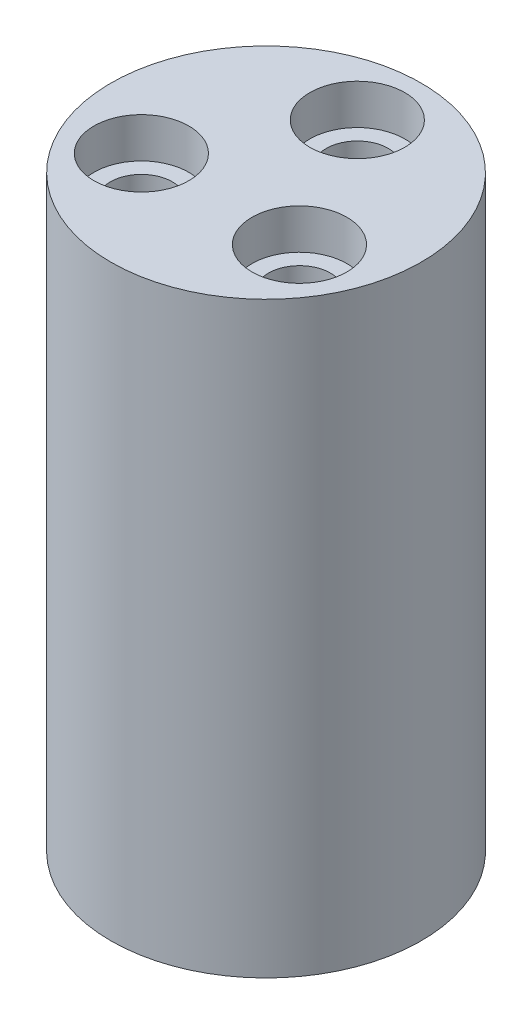
ISO-10303-21;
HEADER;
FILE_DESCRIPTION(('STEP AP214'),'2;1');
FILE_NAME('part.step','',(''),(''),'','','');
FILE_SCHEMA(('AUTOMOTIVE_DESIGN { 1 0 10303 214 1 1 1 1 }'));
ENDSEC;
DATA;
#1=APPLICATION_CONTEXT('core data for automotive mechanical design processes');
#2=APPLICATION_PROTOCOL_DEFINITION('international standard','automotive_design',2000,#1);
#3=PRODUCT_CONTEXT('',#1,'mechanical');
#4=PRODUCT('Part','Part','',(#3));
#5=PRODUCT_RELATED_PRODUCT_CATEGORY('part','',(#4));
#6=PRODUCT_DEFINITION_FORMATION('','',#4);
#7=PRODUCT_DEFINITION_CONTEXT('part definition',#1,'design');
#8=PRODUCT_DEFINITION('design','',#6,#7);
#9=PRODUCT_DEFINITION_SHAPE('','',#8);
#10=(LENGTH_UNIT() NAMED_UNIT(*) SI_UNIT(.MILLI.,.METRE.));
#11=(NAMED_UNIT(*) PLANE_ANGLE_UNIT() SI_UNIT($,.RADIAN.));
#12=(NAMED_UNIT(*) SI_UNIT($,.STERADIAN.) SOLID_ANGLE_UNIT());
#13=UNCERTAINTY_MEASURE_WITH_UNIT(LENGTH_MEASURE(1.E-05),#10,'distance_accuracy_value','');
#14=(GEOMETRIC_REPRESENTATION_CONTEXT(3) GLOBAL_UNCERTAINTY_ASSIGNED_CONTEXT((#13)) GLOBAL_UNIT_ASSIGNED_CONTEXT((#10,
#11,#12)) REPRESENTATION_CONTEXT('',''));
#15=CARTESIAN_POINT('',(0.,0.,0.));
#16=DIRECTION('',(0.,0.,1.));
#17=DIRECTION('',(1.,0.,0.));
#18=AXIS2_PLACEMENT_3D('',#15,#16,#17);
#19=CARTESIAN_POINT('',(0.,32.2,-5.));
#20=DIRECTION('',(0.,-1.,0.));
#21=DIRECTION('',(0.,0.,-1.));
#22=AXIS2_PLACEMENT_3D('',#19,#20,#21);
#23=CYLINDRICAL_SURFACE('',#22,1.7);
#24=CARTESIAN_POINT('',(0.,0.,-5.));
#25=DIRECTION('',(0.,1.,0.));
#26=DIRECTION('',(0.,0.,1.));
#27=AXIS2_PLACEMENT_3D('',#24,#25,#26);
#28=CIRCLE('',#27,1.7);
#29=CARTESIAN_POINT('',(0.,0.,-3.3));
#30=VERTEX_POINT('',#29);
#31=EDGE_CURVE('E52',#30,#30,#28,.T.);
#32=ORIENTED_EDGE('',*,*,#31,.F.);
#33=EDGE_LOOP('',(#32));
#34=FACE_BOUND('',#33,.T.);
#35=CARTESIAN_POINT('',(0.,30.,-5.));
#36=DIRECTION('',(0.,1.,0.));
#37=DIRECTION('',(0.,0.,1.));
#38=AXIS2_PLACEMENT_3D('',#35,#36,#37);
#39=CIRCLE('',#38,1.7);
#40=CARTESIAN_POINT('',(0.,30.,-3.3));
#41=VERTEX_POINT('',#40);
#42=EDGE_CURVE('E41',#41,#41,#39,.T.);
#43=ORIENTED_EDGE('',*,*,#42,.T.);
#44=EDGE_LOOP('',(#43));
#45=FACE_BOUND('',#44,.T.);
#46=ADVANCED_FACE('F37',(#34,#45),#23,.F.);
#47=CARTESIAN_POINT('',(4.33012701892219,32.2,2.5));
#48=DIRECTION('',(0.,-1.,0.));
#49=DIRECTION('',(0.,0.,-1.));
#50=AXIS2_PLACEMENT_3D('',#47,#48,#49);
#51=CYLINDRICAL_SURFACE('',#50,1.7);
#52=CARTESIAN_POINT('',(4.33012701892219,0.,2.5));
#53=DIRECTION('',(0.,1.,0.));
#54=DIRECTION('',(0.,0.,1.));
#55=AXIS2_PLACEMENT_3D('',#52,#53,#54);
#56=CIRCLE('',#55,1.7);
#57=CARTESIAN_POINT('',(4.33012701892219,0.,4.2));
#58=VERTEX_POINT('',#57);
#59=EDGE_CURVE('E73',#58,#58,#56,.T.);
#60=ORIENTED_EDGE('',*,*,#59,.F.);
#61=EDGE_LOOP('',(#60));
#62=FACE_BOUND('',#61,.T.);
#63=CARTESIAN_POINT('',(4.33012701892219,30.,2.5));
#64=DIRECTION('',(0.,1.,0.));
#65=DIRECTION('',(0.,0.,1.));
#66=AXIS2_PLACEMENT_3D('',#63,#64,#65);
#67=CIRCLE('',#66,1.7);
#68=CARTESIAN_POINT('',(4.33012701892219,30.,4.2));
#69=VERTEX_POINT('',#68);
#70=EDGE_CURVE('E60',#69,#69,#67,.T.);
#71=ORIENTED_EDGE('',*,*,#70,.T.);
#72=EDGE_LOOP('',(#71));
#73=FACE_BOUND('',#72,.T.);
#74=ADVANCED_FACE('F139',(#62,#73),#51,.F.);
#75=CARTESIAN_POINT('',(-4.33012701892219,32.2,2.5));
#76=DIRECTION('',(0.,-1.,0.));
#77=DIRECTION('',(0.,0.,-1.));
#78=AXIS2_PLACEMENT_3D('',#75,#76,#77);
#79=CYLINDRICAL_SURFACE('',#78,1.7);
#80=CARTESIAN_POINT('',(-4.33012701892219,0.,2.5));
#81=DIRECTION('',(0.,1.,0.));
#82=DIRECTION('',(0.,0.,1.));
#83=AXIS2_PLACEMENT_3D('',#80,#81,#82);
#84=CIRCLE('',#83,1.7);
#85=CARTESIAN_POINT('',(-4.33012701892219,0.,4.2));
#86=VERTEX_POINT('',#85);
#87=EDGE_CURVE('E68',#86,#86,#84,.T.);
#88=ORIENTED_EDGE('',*,*,#87,.F.);
#89=EDGE_LOOP('',(#88));
#90=FACE_BOUND('',#89,.T.);
#91=CARTESIAN_POINT('',(-4.33012701892219,30.,2.5));
#92=DIRECTION('',(0.,1.,0.));
#93=DIRECTION('',(0.,0.,1.));
#94=AXIS2_PLACEMENT_3D('',#91,#92,#93);
#95=CIRCLE('',#94,1.7);
#96=CARTESIAN_POINT('',(-4.33012701892219,30.,4.2));
#97=VERTEX_POINT('',#96);
#98=EDGE_CURVE('E57',#97,#97,#95,.T.);
#99=ORIENTED_EDGE('',*,*,#98,.T.);
#100=EDGE_LOOP('',(#99));
#101=FACE_BOUND('',#100,.T.);
#102=ADVANCED_FACE('F117',(#90,#101),#79,.F.);
#103=CARTESIAN_POINT('',(0.,32.2,0.));
#104=DIRECTION('',(0.,1.,0.));
#105=DIRECTION('',(0.,0.,1.));
#106=AXIS2_PLACEMENT_3D('',#103,#104,#105);
#107=PLANE('',#106);
#108=CARTESIAN_POINT('',(0.,32.2,-5.));
#109=DIRECTION('',(0.,1.,0.));
#110=DIRECTION('',(0.,0.,1.));
#111=AXIS2_PLACEMENT_3D('',#108,#109,#110);
#112=CIRCLE('',#111,2.6);
#113=CARTESIAN_POINT('',(0.,32.2,-2.4));
#114=VERTEX_POINT('',#113);
#115=EDGE_CURVE('E96',#114,#114,#112,.T.);
#116=ORIENTED_EDGE('',*,*,#115,.F.);
#117=EDGE_LOOP('',(#116));
#118=FACE_BOUND('',#117,.T.);
#119=CARTESIAN_POINT('',(4.33012701892219,32.2,2.5));
#120=DIRECTION('',(0.,1.,0.));
#121=DIRECTION('',(0.,0.,1.));
#122=AXIS2_PLACEMENT_3D('',#119,#120,#121);
#123=CIRCLE('',#122,2.6);
#124=CARTESIAN_POINT('',(4.33012701892219,32.2,5.1));
#125=VERTEX_POINT('',#124);
#126=EDGE_CURVE('E88',#125,#125,#123,.T.);
#127=ORIENTED_EDGE('',*,*,#126,.F.);
#128=EDGE_LOOP('',(#127));
#129=FACE_BOUND('',#128,.T.);
#130=CARTESIAN_POINT('',(-4.33012701892219,32.2,2.5));
#131=DIRECTION('',(0.,1.,0.));
#132=DIRECTION('',(0.,0.,1.));
#133=AXIS2_PLACEMENT_3D('',#130,#131,#132);
#134=CIRCLE('',#133,2.6);
#135=CARTESIAN_POINT('',(-4.33012701892219,32.2,5.1));
#136=VERTEX_POINT('',#135);
#137=EDGE_CURVE('E80',#136,#136,#134,.T.);
#138=ORIENTED_EDGE('',*,*,#137,.F.);
#139=EDGE_LOOP('',(#138));
#140=FACE_BOUND('',#139,.T.);
#141=CARTESIAN_POINT('',(0.,32.2,0.));
#142=DIRECTION('',(0.,1.,0.));
#143=DIRECTION('',(0.,0.,1.));
#144=AXIS2_PLACEMENT_3D('',#141,#142,#143);
#145=CIRCLE('',#144,8.5);
#146=CARTESIAN_POINT('',(0.,32.2,8.5));
#147=VERTEX_POINT('',#146);
#148=EDGE_CURVE('E10',#147,#147,#145,.T.);
#149=ORIENTED_EDGE('',*,*,#148,.T.);
#150=EDGE_LOOP('',(#149));
#151=FACE_BOUND('',#150,.T.);
#152=ADVANCED_FACE('F113',(#118,#129,#140,#151),#107,.T.);
#153=CARTESIAN_POINT('',(0.,0.,0.));
#154=DIRECTION('',(0.,1.,0.));
#155=DIRECTION('',(0.,0.,1.));
#156=AXIS2_PLACEMENT_3D('',#153,#154,#155);
#157=PLANE('',#156);
#158=CARTESIAN_POINT('',(0.,0.,0.));
#159=DIRECTION('',(0.,1.,0.));
#160=DIRECTION('',(0.,0.,1.));
#161=AXIS2_PLACEMENT_3D('',#158,#159,#160);
#162=CIRCLE('',#161,8.5);
#163=CARTESIAN_POINT('',(0.,0.,8.5));
#164=VERTEX_POINT('',#163);
#165=EDGE_CURVE('E46',#164,#164,#162,.T.);
#166=ORIENTED_EDGE('',*,*,#165,.F.);
#167=EDGE_LOOP('',(#166));
#168=FACE_BOUND('',#167,.T.);
#169=ORIENTED_EDGE('',*,*,#31,.T.);
#170=EDGE_LOOP('',(#169));
#171=FACE_BOUND('',#170,.T.);
#172=ORIENTED_EDGE('',*,*,#59,.T.);
#173=EDGE_LOOP('',(#172));
#174=FACE_BOUND('',#173,.T.);
#175=ORIENTED_EDGE('',*,*,#87,.T.);
#176=EDGE_LOOP('',(#175));
#177=FACE_BOUND('',#176,.T.);
#178=ADVANCED_FACE('F116',(#168,#171,#174,#177),#157,.F.);
#179=CARTESIAN_POINT('',(0.,32.2,0.));
#180=DIRECTION('',(0.,-1.,0.));
#181=DIRECTION('',(0.,0.,-1.));
#182=AXIS2_PLACEMENT_3D('',#179,#180,#181);
#183=CYLINDRICAL_SURFACE('',#182,8.5);
#184=ORIENTED_EDGE('',*,*,#148,.F.);
#185=EDGE_LOOP('',(#184));
#186=FACE_BOUND('',#185,.T.);
#187=ORIENTED_EDGE('',*,*,#165,.T.);
#188=EDGE_LOOP('',(#187));
#189=FACE_BOUND('',#188,.T.);
#190=ADVANCED_FACE('F39',(#186,#189),#183,.T.);
#191=CARTESIAN_POINT('',(-4.33012701892219,30.,2.5));
#192=DIRECTION('',(0.,1.,0.));
#193=DIRECTION('',(0.,0.,1.));
#194=AXIS2_PLACEMENT_3D('',#191,#192,#193);
#195=CYLINDRICAL_SURFACE('',#194,2.6);
#196=CARTESIAN_POINT('',(-4.33012701892219,30.,2.5));
#197=DIRECTION('',(0.,1.,0.));
#198=DIRECTION('',(0.,0.,1.));
#199=AXIS2_PLACEMENT_3D('',#196,#197,#198);
#200=CIRCLE('',#199,2.6);
#201=CARTESIAN_POINT('',(-4.33012701892219,30.,5.1));
#202=VERTEX_POINT('',#201);
#203=EDGE_CURVE('E84',#202,#202,#200,.T.);
#204=ORIENTED_EDGE('',*,*,#203,.F.);
#205=EDGE_LOOP('',(#204));
#206=FACE_BOUND('',#205,.T.);
#207=ORIENTED_EDGE('',*,*,#137,.T.);
#208=EDGE_LOOP('',(#207));
#209=FACE_BOUND('',#208,.T.);
#210=ADVANCED_FACE('F123',(#206,#209),#195,.F.);
#211=CARTESIAN_POINT('',(-4.33012701892219,30.,2.5));
#212=DIRECTION('',(0.,1.,0.));
#213=DIRECTION('',(0.,0.,1.));
#214=AXIS2_PLACEMENT_3D('',#211,#212,#213);
#215=PLANE('',#214);
#216=ORIENTED_EDGE('',*,*,#98,.F.);
#217=EDGE_LOOP('',(#216));
#218=FACE_BOUND('',#217,.T.);
#219=ORIENTED_EDGE('',*,*,#203,.T.);
#220=EDGE_LOOP('',(#219));
#221=FACE_BOUND('',#220,.T.);
#222=ADVANCED_FACE('F125',(#218,#221),#215,.T.);
#223=CARTESIAN_POINT('',(4.33012701892219,30.,2.5));
#224=DIRECTION('',(0.,1.,0.));
#225=DIRECTION('',(0.,0.,1.));
#226=AXIS2_PLACEMENT_3D('',#223,#224,#225);
#227=CYLINDRICAL_SURFACE('',#226,2.6);
#228=CARTESIAN_POINT('',(4.33012701892219,30.,2.5));
#229=DIRECTION('',(0.,1.,0.));
#230=DIRECTION('',(0.,0.,1.));
#231=AXIS2_PLACEMENT_3D('',#228,#229,#230);
#232=CIRCLE('',#231,2.6);
#233=CARTESIAN_POINT('',(4.33012701892219,30.,5.1));
#234=VERTEX_POINT('',#233);
#235=EDGE_CURVE('E92',#234,#234,#232,.T.);
#236=ORIENTED_EDGE('',*,*,#235,.F.);
#237=EDGE_LOOP('',(#236));
#238=FACE_BOUND('',#237,.T.);
#239=ORIENTED_EDGE('',*,*,#126,.T.);
#240=EDGE_LOOP('',(#239));
#241=FACE_BOUND('',#240,.T.);
#242=ADVANCED_FACE('F132',(#238,#241),#227,.F.);
#243=CARTESIAN_POINT('',(4.33012701892219,30.,2.5));
#244=DIRECTION('',(0.,1.,0.));
#245=DIRECTION('',(0.,0.,1.));
#246=AXIS2_PLACEMENT_3D('',#243,#244,#245);
#247=PLANE('',#246);
#248=ORIENTED_EDGE('',*,*,#70,.F.);
#249=EDGE_LOOP('',(#248));
#250=FACE_BOUND('',#249,.T.);
#251=ORIENTED_EDGE('',*,*,#235,.T.);
#252=EDGE_LOOP('',(#251));
#253=FACE_BOUND('',#252,.T.);
#254=ADVANCED_FACE('F109',(#250,#253),#247,.T.);
#255=CARTESIAN_POINT('',(0.,30.,-5.));
#256=DIRECTION('',(0.,1.,0.));
#257=DIRECTION('',(0.,0.,1.));
#258=AXIS2_PLACEMENT_3D('',#255,#256,#257);
#259=CYLINDRICAL_SURFACE('',#258,2.6);
#260=CARTESIAN_POINT('',(0.,30.,-5.));
#261=DIRECTION('',(0.,1.,0.));
#262=DIRECTION('',(0.,0.,1.));
#263=AXIS2_PLACEMENT_3D('',#260,#261,#262);
#264=CIRCLE('',#263,2.6);
#265=CARTESIAN_POINT('',(0.,30.,-2.4));
#266=VERTEX_POINT('',#265);
#267=EDGE_CURVE('E61',#266,#266,#264,.T.);
#268=ORIENTED_EDGE('',*,*,#267,.F.);
#269=EDGE_LOOP('',(#268));
#270=FACE_BOUND('',#269,.T.);
#271=ORIENTED_EDGE('',*,*,#115,.T.);
#272=EDGE_LOOP('',(#271));
#273=FACE_BOUND('',#272,.T.);
#274=ADVANCED_FACE('F106',(#270,#273),#259,.F.);
#275=CARTESIAN_POINT('',(0.,30.,-5.));
#276=DIRECTION('',(0.,1.,0.));
#277=DIRECTION('',(0.,0.,1.));
#278=AXIS2_PLACEMENT_3D('',#275,#276,#277);
#279=PLANE('',#278);
#280=ORIENTED_EDGE('',*,*,#42,.F.);
#281=EDGE_LOOP('',(#280));
#282=FACE_BOUND('',#281,.T.);
#283=ORIENTED_EDGE('',*,*,#267,.T.);
#284=EDGE_LOOP('',(#283));
#285=FACE_BOUND('',#284,.T.);
#286=ADVANCED_FACE('F104',(#282,#285),#279,.T.);
#287=CLOSED_SHELL('',(#46,#74,#102,#152,#178,#190,#210,#222,#242,#254,#274,#286));
#288=MANIFOLD_SOLID_BREP('B2',#287);
#289=ADVANCED_BREP_SHAPE_REPRESENTATION('',(#18,#288),#14);
#290=SHAPE_DEFINITION_REPRESENTATION(#9,#289);
ENDSEC;
END-ISO-10303-21;
